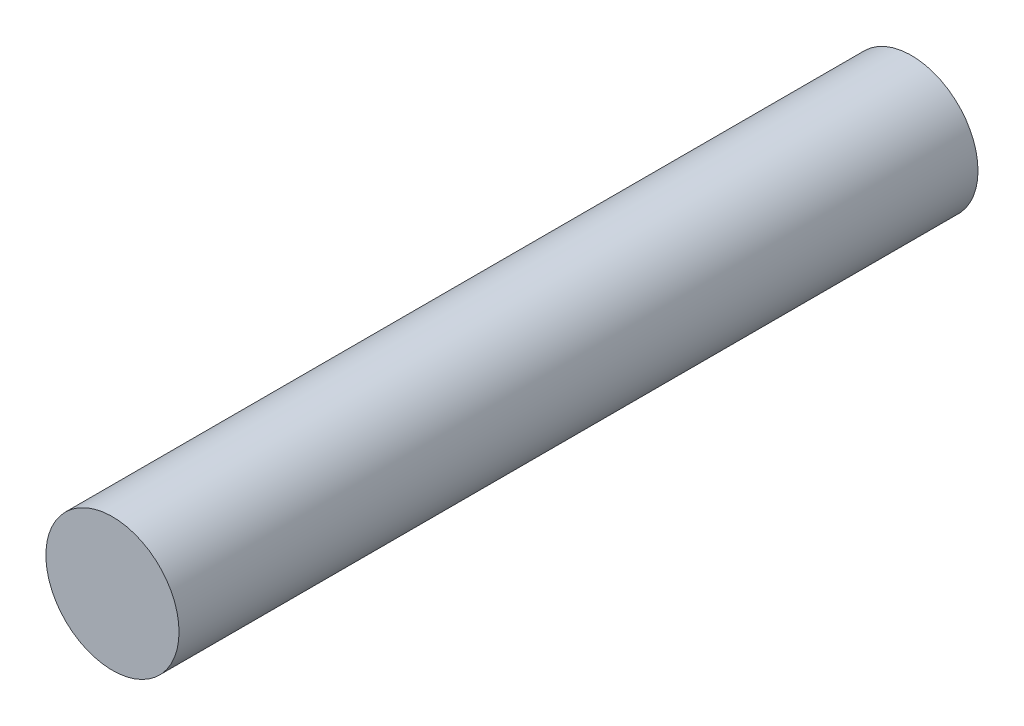
ISO-10303-21;
HEADER;
FILE_DESCRIPTION(('STEP AP214'),'2;1');
FILE_NAME('part.step','',(''),(''),'','','');
FILE_SCHEMA(('AUTOMOTIVE_DESIGN { 1 0 10303 214 1 1 1 1 }'));
ENDSEC;
DATA;
#1=APPLICATION_CONTEXT('core data for automotive mechanical design processes');
#2=APPLICATION_PROTOCOL_DEFINITION('international standard','automotive_design',2000,#1);
#3=PRODUCT_CONTEXT('',#1,'mechanical');
#4=PRODUCT('Part','Part','',(#3));
#5=PRODUCT_RELATED_PRODUCT_CATEGORY('part','',(#4));
#6=PRODUCT_DEFINITION_FORMATION('','',#4);
#7=PRODUCT_DEFINITION_CONTEXT('part definition',#1,'design');
#8=PRODUCT_DEFINITION('design','',#6,#7);
#9=PRODUCT_DEFINITION_SHAPE('','',#8);
#10=(LENGTH_UNIT() NAMED_UNIT(*) SI_UNIT(.MILLI.,.METRE.));
#11=(NAMED_UNIT(*) PLANE_ANGLE_UNIT() SI_UNIT($,.RADIAN.));
#12=(NAMED_UNIT(*) SI_UNIT($,.STERADIAN.) SOLID_ANGLE_UNIT());
#13=UNCERTAINTY_MEASURE_WITH_UNIT(LENGTH_MEASURE(1.E-05),#10,'distance_accuracy_value','');
#14=(GEOMETRIC_REPRESENTATION_CONTEXT(3) GLOBAL_UNCERTAINTY_ASSIGNED_CONTEXT((#13)) GLOBAL_UNIT_ASSIGNED_CONTEXT((#10,
#11,#12)) REPRESENTATION_CONTEXT('',''));
#15=CARTESIAN_POINT('',(0.,0.,0.));
#16=DIRECTION('',(0.,0.,1.));
#17=DIRECTION('',(1.,0.,0.));
#18=AXIS2_PLACEMENT_3D('',#15,#16,#17);
#19=CARTESIAN_POINT('',(0.,0.,120.));
#20=DIRECTION('',(0.,0.,-1.));
#21=DIRECTION('',(-1.,0.,0.));
#22=AXIS2_PLACEMENT_3D('',#19,#20,#21);
#23=CYLINDRICAL_SURFACE('',#22,10.);
#24=CARTESIAN_POINT('',(0.,0.,120.));
#25=DIRECTION('',(0.,0.,1.));
#26=DIRECTION('',(1.,0.,0.));
#27=AXIS2_PLACEMENT_3D('',#24,#25,#26);
#28=CIRCLE('',#27,10.);
#29=CARTESIAN_POINT('',(10.,0.,120.));
#30=VERTEX_POINT('',#29);
#31=EDGE_CURVE('E10',#30,#30,#28,.T.);
#32=ORIENTED_EDGE('',*,*,#31,.F.);
#33=EDGE_LOOP('',(#32));
#34=FACE_BOUND('',#33,.T.);
#35=CARTESIAN_POINT('',(0.,0.,0.));
#36=DIRECTION('',(0.,0.,1.));
#37=DIRECTION('',(1.,0.,0.));
#38=AXIS2_PLACEMENT_3D('',#35,#36,#37);
#39=CIRCLE('',#38,10.);
#40=CARTESIAN_POINT('',(10.,0.,0.));
#41=VERTEX_POINT('',#40);
#42=EDGE_CURVE('E36',#41,#41,#39,.T.);
#43=ORIENTED_EDGE('',*,*,#42,.T.);
#44=EDGE_LOOP('',(#43));
#45=FACE_BOUND('',#44,.T.);
#46=ADVANCED_FACE('F33',(#34,#45),#23,.T.);
#47=CARTESIAN_POINT('',(0.,0.,120.));
#48=DIRECTION('',(0.,0.,1.));
#49=DIRECTION('',(1.,0.,0.));
#50=AXIS2_PLACEMENT_3D('',#47,#48,#49);
#51=PLANE('',#50);
#52=ORIENTED_EDGE('',*,*,#31,.T.);
#53=EDGE_LOOP('',(#52));
#54=FACE_BOUND('',#53,.T.);
#55=ADVANCED_FACE('F48',(#54),#51,.T.);
#56=CARTESIAN_POINT('',(0.,0.,0.));
#57=DIRECTION('',(0.,0.,1.));
#58=DIRECTION('',(1.,0.,0.));
#59=AXIS2_PLACEMENT_3D('',#56,#57,#58);
#60=PLANE('',#59);
#61=ORIENTED_EDGE('',*,*,#42,.F.);
#62=EDGE_LOOP('',(#61));
#63=FACE_BOUND('',#62,.T.);
#64=ADVANCED_FACE('F46',(#63),#60,.F.);
#65=CLOSED_SHELL('',(#46,#55,#64));
#66=MANIFOLD_SOLID_BREP('B2',#65);
#67=ADVANCED_BREP_SHAPE_REPRESENTATION('',(#18,#66),#14);
#68=SHAPE_DEFINITION_REPRESENTATION(#9,#67);
ENDSEC;
END-ISO-10303-21;
